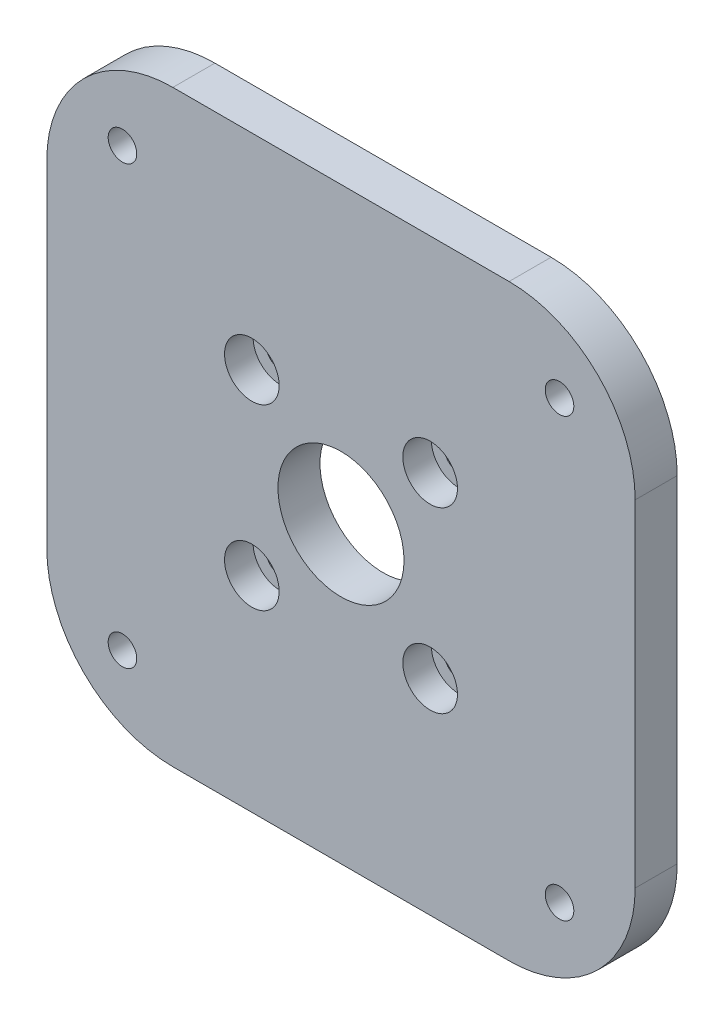
ISO-10303-21;
HEADER;
FILE_DESCRIPTION(('STEP AP214'),'2;1');
FILE_NAME('part.step','',(''),(''),'','','');
FILE_SCHEMA(('AUTOMOTIVE_DESIGN { 1 0 10303 214 1 1 1 1 }'));
ENDSEC;
DATA;
#1=APPLICATION_CONTEXT('core data for automotive mechanical design processes');
#2=APPLICATION_PROTOCOL_DEFINITION('international standard','automotive_design',2000,#1);
#3=PRODUCT_CONTEXT('',#1,'mechanical');
#4=PRODUCT('Part','Part','',(#3));
#5=PRODUCT_RELATED_PRODUCT_CATEGORY('part','',(#4));
#6=PRODUCT_DEFINITION_FORMATION('','',#4);
#7=PRODUCT_DEFINITION_CONTEXT('part definition',#1,'design');
#8=PRODUCT_DEFINITION('design','',#6,#7);
#9=PRODUCT_DEFINITION_SHAPE('','',#8);
#10=(LENGTH_UNIT() NAMED_UNIT(*) SI_UNIT(.MILLI.,.METRE.));
#11=(NAMED_UNIT(*) PLANE_ANGLE_UNIT() SI_UNIT($,.RADIAN.));
#12=(NAMED_UNIT(*) SI_UNIT($,.STERADIAN.) SOLID_ANGLE_UNIT());
#13=UNCERTAINTY_MEASURE_WITH_UNIT(LENGTH_MEASURE(1.E-05),#10,'distance_accuracy_value','');
#14=(GEOMETRIC_REPRESENTATION_CONTEXT(3) GLOBAL_UNCERTAINTY_ASSIGNED_CONTEXT((#13)) GLOBAL_UNIT_ASSIGNED_CONTEXT((#10,
#11,#12)) REPRESENTATION_CONTEXT('',''));
#15=CARTESIAN_POINT('',(0.,0.,0.));
#16=DIRECTION('',(0.,0.,1.));
#17=DIRECTION('',(1.,0.,0.));
#18=AXIS2_PLACEMENT_3D('',#15,#16,#17);
#19=CARTESIAN_POINT('',(35.,35.,5.));
#20=DIRECTION('',(-1.,0.,0.));
#21=DIRECTION('',(0.,0.,1.));
#22=AXIS2_PLACEMENT_3D('',#19,#20,#21);
#23=PLANE('',#22);
#24=DIRECTION('',(0.,1.,0.));
#25=VECTOR('',#24,1.);
#26=CARTESIAN_POINT('',(35.,35.,0.));
#27=LINE('',#26,#25);
#28=CARTESIAN_POINT('',(35.,-20.,0.));
#29=VERTEX_POINT('',#28);
#30=CARTESIAN_POINT('',(35.,20.,0.));
#31=VERTEX_POINT('',#30);
#32=EDGE_CURVE('E186',#29,#31,#27,.T.);
#33=ORIENTED_EDGE('',*,*,#32,.T.);
#34=DIRECTION('',(0.,0.,-1.));
#35=VECTOR('',#34,1.);
#36=CARTESIAN_POINT('',(35.,20.,5.));
#37=LINE('',#36,#35);
#38=CARTESIAN_POINT('',(35.,20.,5.));
#39=VERTEX_POINT('',#38);
#40=EDGE_CURVE('E11',#31,#39,#37,.F.);
#41=ORIENTED_EDGE('',*,*,#40,.T.);
#42=DIRECTION('',(0.,1.,0.));
#43=VECTOR('',#42,1.);
#44=CARTESIAN_POINT('',(35.,35.,5.));
#45=LINE('',#44,#43);
#46=CARTESIAN_POINT('',(35.,-20.,5.));
#47=VERTEX_POINT('',#46);
#48=EDGE_CURVE('E139',#47,#39,#45,.T.);
#49=ORIENTED_EDGE('',*,*,#48,.F.);
#50=DIRECTION('',(0.,0.,-1.));
#51=VECTOR('',#50,1.);
#52=CARTESIAN_POINT('',(35.,-20.,5.));
#53=LINE('',#52,#51);
#54=EDGE_CURVE('E52',#47,#29,#53,.T.);
#55=ORIENTED_EDGE('',*,*,#54,.T.);
#56=EDGE_LOOP('',(#33,#41,#49,#55));
#57=FACE_BOUND('',#56,.T.);
#58=ADVANCED_FACE('F43',(#57),#23,.F.);
#59=CARTESIAN_POINT('',(-35.,35.,5.));
#60=DIRECTION('',(0.,-1.,0.));
#61=DIRECTION('',(0.,0.,-1.));
#62=AXIS2_PLACEMENT_3D('',#59,#60,#61);
#63=PLANE('',#62);
#64=DIRECTION('',(-1.,0.,0.));
#65=VECTOR('',#64,1.);
#66=CARTESIAN_POINT('',(-35.,35.,0.));
#67=LINE('',#66,#65);
#68=CARTESIAN_POINT('',(20.,35.,0.));
#69=VERTEX_POINT('',#68);
#70=CARTESIAN_POINT('',(-20.,35.,0.));
#71=VERTEX_POINT('',#70);
#72=EDGE_CURVE('E146',#69,#71,#67,.T.);
#73=ORIENTED_EDGE('',*,*,#72,.T.);
#74=DIRECTION('',(0.,0.,-1.));
#75=VECTOR('',#74,1.);
#76=CARTESIAN_POINT('',(-20.,35.,5.));
#77=LINE('',#76,#75);
#78=CARTESIAN_POINT('',(-20.,35.,5.));
#79=VERTEX_POINT('',#78);
#80=EDGE_CURVE('E59',#71,#79,#77,.F.);
#81=ORIENTED_EDGE('',*,*,#80,.T.);
#82=DIRECTION('',(-1.,0.,0.));
#83=VECTOR('',#82,1.);
#84=CARTESIAN_POINT('',(-35.,35.,5.));
#85=LINE('',#84,#83);
#86=CARTESIAN_POINT('',(20.,35.,5.));
#87=VERTEX_POINT('',#86);
#88=EDGE_CURVE('E144',#87,#79,#85,.T.);
#89=ORIENTED_EDGE('',*,*,#88,.F.);
#90=DIRECTION('',(0.,0.,-1.));
#91=VECTOR('',#90,1.);
#92=CARTESIAN_POINT('',(20.,35.,5.));
#93=LINE('',#92,#91);
#94=EDGE_CURVE('E175',#87,#69,#93,.T.);
#95=ORIENTED_EDGE('',*,*,#94,.T.);
#96=EDGE_LOOP('',(#73,#81,#89,#95));
#97=FACE_BOUND('',#96,.T.);
#98=ADVANCED_FACE('F336',(#97),#63,.F.);
#99=CARTESIAN_POINT('',(-35.,35.,5.));
#100=DIRECTION('',(1.,0.,0.));
#101=DIRECTION('',(0.,0.,-1.));
#102=AXIS2_PLACEMENT_3D('',#99,#100,#101);
#103=PLANE('',#102);
#104=DIRECTION('',(0.,-1.,0.));
#105=VECTOR('',#104,1.);
#106=CARTESIAN_POINT('',(-35.,35.,0.));
#107=LINE('',#106,#105);
#108=CARTESIAN_POINT('',(-35.,20.,0.));
#109=VERTEX_POINT('',#108);
#110=CARTESIAN_POINT('',(-35.,-20.,0.));
#111=VERTEX_POINT('',#110);
#112=EDGE_CURVE('E140',#109,#111,#107,.T.);
#113=ORIENTED_EDGE('',*,*,#112,.T.);
#114=DIRECTION('',(0.,0.,-1.));
#115=VECTOR('',#114,1.);
#116=CARTESIAN_POINT('',(-35.,-20.,5.));
#117=LINE('',#116,#115);
#118=CARTESIAN_POINT('',(-35.,-20.,5.));
#119=VERTEX_POINT('',#118);
#120=EDGE_CURVE('E115',#111,#119,#117,.F.);
#121=ORIENTED_EDGE('',*,*,#120,.T.);
#122=DIRECTION('',(0.,-1.,0.));
#123=VECTOR('',#122,1.);
#124=CARTESIAN_POINT('',(-35.,35.,5.));
#125=LINE('',#124,#123);
#126=CARTESIAN_POINT('',(-35.,20.,5.));
#127=VERTEX_POINT('',#126);
#128=EDGE_CURVE('E202',#127,#119,#125,.T.);
#129=ORIENTED_EDGE('',*,*,#128,.F.);
#130=DIRECTION('',(0.,0.,-1.));
#131=VECTOR('',#130,1.);
#132=CARTESIAN_POINT('',(-35.,20.,5.));
#133=LINE('',#132,#131);
#134=EDGE_CURVE('E121',#127,#109,#133,.T.);
#135=ORIENTED_EDGE('',*,*,#134,.T.);
#136=EDGE_LOOP('',(#113,#121,#129,#135));
#137=FACE_BOUND('',#136,.T.);
#138=ADVANCED_FACE('F333',(#137),#103,.F.);
#139=CARTESIAN_POINT('',(-35.,-35.,5.));
#140=DIRECTION('',(0.,1.,0.));
#141=DIRECTION('',(0.,0.,1.));
#142=AXIS2_PLACEMENT_3D('',#139,#140,#141);
#143=PLANE('',#142);
#144=DIRECTION('',(1.,0.,0.));
#145=VECTOR('',#144,1.);
#146=CARTESIAN_POINT('',(-35.,-35.,5.));
#147=LINE('',#146,#145);
#148=CARTESIAN_POINT('',(-20.,-35.,5.));
#149=VERTEX_POINT('',#148);
#150=CARTESIAN_POINT('',(20.,-35.,5.));
#151=VERTEX_POINT('',#150);
#152=EDGE_CURVE('E131',#149,#151,#147,.T.);
#153=ORIENTED_EDGE('',*,*,#152,.F.);
#154=DIRECTION('',(0.,0.,-1.));
#155=VECTOR('',#154,1.);
#156=CARTESIAN_POINT('',(-20.,-35.,5.));
#157=LINE('',#156,#155);
#158=CARTESIAN_POINT('',(-20.,-35.,0.));
#159=VERTEX_POINT('',#158);
#160=EDGE_CURVE('E114',#149,#159,#157,.T.);
#161=ORIENTED_EDGE('',*,*,#160,.T.);
#162=DIRECTION('',(1.,0.,0.));
#163=VECTOR('',#162,1.);
#164=CARTESIAN_POINT('',(-35.,-35.,0.));
#165=LINE('',#164,#163);
#166=CARTESIAN_POINT('',(20.,-35.,0.));
#167=VERTEX_POINT('',#166);
#168=EDGE_CURVE('E128',#159,#167,#165,.T.);
#169=ORIENTED_EDGE('',*,*,#168,.T.);
#170=DIRECTION('',(0.,0.,-1.));
#171=VECTOR('',#170,1.);
#172=CARTESIAN_POINT('',(20.,-35.,5.));
#173=LINE('',#172,#171);
#174=EDGE_CURVE('E134',#167,#151,#173,.F.);
#175=ORIENTED_EDGE('',*,*,#174,.T.);
#176=EDGE_LOOP('',(#153,#161,#169,#175));
#177=FACE_BOUND('',#176,.T.);
#178=ADVANCED_FACE('F127',(#177),#143,.F.);
#179=CARTESIAN_POINT('',(0.,0.,5.));
#180=DIRECTION('',(0.,0.,1.));
#181=DIRECTION('',(1.,0.,0.));
#182=AXIS2_PLACEMENT_3D('',#179,#180,#181);
#183=PLANE('',#182);
#184=CARTESIAN_POINT('',(26.0000000000001,26.,5.));
#185=DIRECTION('',(0.,0.,1.));
#186=DIRECTION('',(1.,0.,0.));
#187=AXIS2_PLACEMENT_3D('',#184,#185,#186);
#188=CIRCLE('',#187,1.7);
#189=CARTESIAN_POINT('',(27.7000000000001,26.,5.));
#190=VERTEX_POINT('',#189);
#191=EDGE_CURVE('E303',#190,#190,#188,.T.);
#192=ORIENTED_EDGE('',*,*,#191,.F.);
#193=EDGE_LOOP('',(#192));
#194=FACE_BOUND('',#193,.T.);
#195=CARTESIAN_POINT('',(-26.,26.,5.));
#196=DIRECTION('',(0.,0.,1.));
#197=DIRECTION('',(1.,0.,0.));
#198=AXIS2_PLACEMENT_3D('',#195,#196,#197);
#199=CIRCLE('',#198,1.7);
#200=CARTESIAN_POINT('',(-24.3,26.,5.));
#201=VERTEX_POINT('',#200);
#202=EDGE_CURVE('E295',#201,#201,#199,.T.);
#203=ORIENTED_EDGE('',*,*,#202,.F.);
#204=EDGE_LOOP('',(#203));
#205=FACE_BOUND('',#204,.T.);
#206=CARTESIAN_POINT('',(-26.,-26.,5.));
#207=DIRECTION('',(0.,0.,1.));
#208=DIRECTION('',(1.,0.,0.));
#209=AXIS2_PLACEMENT_3D('',#206,#207,#208);
#210=CIRCLE('',#209,1.7);
#211=CARTESIAN_POINT('',(-24.3,-26.,5.));
#212=VERTEX_POINT('',#211);
#213=EDGE_CURVE('E287',#212,#212,#210,.T.);
#214=ORIENTED_EDGE('',*,*,#213,.F.);
#215=EDGE_LOOP('',(#214));
#216=FACE_BOUND('',#215,.T.);
#217=CARTESIAN_POINT('',(26.,-26.0000000000001,5.));
#218=DIRECTION('',(0.,0.,1.));
#219=DIRECTION('',(1.,0.,0.));
#220=AXIS2_PLACEMENT_3D('',#217,#218,#219);
#221=CIRCLE('',#220,1.7);
#222=CARTESIAN_POINT('',(27.7,-26.0000000000001,5.));
#223=VERTEX_POINT('',#222);
#224=EDGE_CURVE('E279',#223,#223,#221,.T.);
#225=ORIENTED_EDGE('',*,*,#224,.F.);
#226=EDGE_LOOP('',(#225));
#227=FACE_BOUND('',#226,.T.);
#228=CARTESIAN_POINT('',(0.,0.,5.));
#229=DIRECTION('',(0.,0.,1.));
#230=DIRECTION('',(1.,0.,0.));
#231=AXIS2_PLACEMENT_3D('',#228,#229,#230);
#232=CIRCLE('',#231,7.5);
#233=CARTESIAN_POINT('',(7.5,0.,5.));
#234=VERTEX_POINT('',#233);
#235=EDGE_CURVE('E268',#234,#234,#232,.T.);
#236=ORIENTED_EDGE('',*,*,#235,.F.);
#237=EDGE_LOOP('',(#236));
#238=FACE_BOUND('',#237,.T.);
#239=CARTESIAN_POINT('',(-10.6066017177982,-10.6066017177982,5.));
#240=DIRECTION('',(0.,0.,1.));
#241=DIRECTION('',(1.,0.,0.));
#242=AXIS2_PLACEMENT_3D('',#239,#240,#241);
#243=CIRCLE('',#242,3.25);
#244=CARTESIAN_POINT('',(-7.35660171779822,-10.6066017177982,5.));
#245=VERTEX_POINT('',#244);
#246=EDGE_CURVE('E263',#245,#245,#243,.T.);
#247=ORIENTED_EDGE('',*,*,#246,.F.);
#248=EDGE_LOOP('',(#247));
#249=FACE_BOUND('',#248,.T.);
#250=CARTESIAN_POINT('',(-10.6066017177982,10.6066017177982,5.));
#251=DIRECTION('',(0.,0.,1.));
#252=DIRECTION('',(1.,0.,0.));
#253=AXIS2_PLACEMENT_3D('',#250,#251,#252);
#254=CIRCLE('',#253,3.25);
#255=CARTESIAN_POINT('',(-7.35660171779822,10.6066017177982,5.));
#256=VERTEX_POINT('',#255);
#257=EDGE_CURVE('E247',#256,#256,#254,.T.);
#258=ORIENTED_EDGE('',*,*,#257,.F.);
#259=EDGE_LOOP('',(#258));
#260=FACE_BOUND('',#259,.T.);
#261=CARTESIAN_POINT('',(10.6066017177982,10.6066017177982,5.));
#262=DIRECTION('',(0.,0.,1.));
#263=DIRECTION('',(1.,0.,0.));
#264=AXIS2_PLACEMENT_3D('',#261,#262,#263);
#265=CIRCLE('',#264,3.25);
#266=CARTESIAN_POINT('',(13.8566017177982,10.6066017177982,5.));
#267=VERTEX_POINT('',#266);
#268=EDGE_CURVE('E231',#267,#267,#265,.T.);
#269=ORIENTED_EDGE('',*,*,#268,.F.);
#270=EDGE_LOOP('',(#269));
#271=FACE_BOUND('',#270,.T.);
#272=CARTESIAN_POINT('',(10.6066017177982,-10.6066017177982,5.));
#273=DIRECTION('',(0.,0.,1.));
#274=DIRECTION('',(1.,0.,0.));
#275=AXIS2_PLACEMENT_3D('',#272,#273,#274);
#276=CIRCLE('',#275,3.25);
#277=CARTESIAN_POINT('',(13.8566017177982,-10.6066017177982,5.));
#278=VERTEX_POINT('',#277);
#279=EDGE_CURVE('E215',#278,#278,#276,.T.);
#280=ORIENTED_EDGE('',*,*,#279,.F.);
#281=EDGE_LOOP('',(#280));
#282=FACE_BOUND('',#281,.T.);
#283=ORIENTED_EDGE('',*,*,#128,.T.);
#284=CARTESIAN_POINT('',(-20.,-20.,5.));
#285=DIRECTION('',(0.,0.,1.));
#286=DIRECTION('',(1.,0.,0.));
#287=AXIS2_PLACEMENT_3D('',#284,#285,#286);
#288=CIRCLE('',#287,15.);
#289=EDGE_CURVE('E172',#119,#149,#288,.T.);
#290=ORIENTED_EDGE('',*,*,#289,.T.);
#291=ORIENTED_EDGE('',*,*,#152,.T.);
#292=CARTESIAN_POINT('',(20.,-20.,5.));
#293=DIRECTION('',(0.,0.,1.));
#294=DIRECTION('',(1.,0.,0.));
#295=AXIS2_PLACEMENT_3D('',#292,#293,#294);
#296=CIRCLE('',#295,15.);
#297=EDGE_CURVE('E164',#151,#47,#296,.T.);
#298=ORIENTED_EDGE('',*,*,#297,.T.);
#299=ORIENTED_EDGE('',*,*,#48,.T.);
#300=CARTESIAN_POINT('',(20.,20.,5.));
#301=DIRECTION('',(0.,0.,1.));
#302=DIRECTION('',(1.,0.,0.));
#303=AXIS2_PLACEMENT_3D('',#300,#301,#302);
#304=CIRCLE('',#303,15.);
#305=EDGE_CURVE('E66',#39,#87,#304,.T.);
#306=ORIENTED_EDGE('',*,*,#305,.T.);
#307=ORIENTED_EDGE('',*,*,#88,.T.);
#308=CARTESIAN_POINT('',(-20.,20.,5.));
#309=DIRECTION('',(0.,0.,1.));
#310=DIRECTION('',(1.,0.,0.));
#311=AXIS2_PLACEMENT_3D('',#308,#309,#310);
#312=CIRCLE('',#311,15.);
#313=EDGE_CURVE('E169',#79,#127,#312,.T.);
#314=ORIENTED_EDGE('',*,*,#313,.T.);
#315=EDGE_LOOP('',(#283,#290,#291,#298,#299,#306,#307,#314));
#316=FACE_BOUND('',#315,.T.);
#317=ADVANCED_FACE('F310',(#194,#205,#216,#227,#238,#249,#260,#271,#282,#316),#183,.T.);
#318=CARTESIAN_POINT('',(0.,0.,0.));
#319=DIRECTION('',(0.,0.,1.));
#320=DIRECTION('',(1.,0.,0.));
#321=AXIS2_PLACEMENT_3D('',#318,#319,#320);
#322=PLANE('',#321);
#323=CARTESIAN_POINT('',(26.0000000000001,26.,0.));
#324=DIRECTION('',(0.,0.,1.));
#325=DIRECTION('',(1.,0.,0.));
#326=AXIS2_PLACEMENT_3D('',#323,#324,#325);
#327=CIRCLE('',#326,1.7);
#328=CARTESIAN_POINT('',(27.7000000000001,26.,0.));
#329=VERTEX_POINT('',#328);
#330=EDGE_CURVE('E299',#329,#329,#327,.T.);
#331=ORIENTED_EDGE('',*,*,#330,.T.);
#332=EDGE_LOOP('',(#331));
#333=FACE_BOUND('',#332,.T.);
#334=CARTESIAN_POINT('',(-26.,26.,0.));
#335=DIRECTION('',(0.,0.,1.));
#336=DIRECTION('',(1.,0.,0.));
#337=AXIS2_PLACEMENT_3D('',#334,#335,#336);
#338=CIRCLE('',#337,1.7);
#339=CARTESIAN_POINT('',(-24.3,26.,0.));
#340=VERTEX_POINT('',#339);
#341=EDGE_CURVE('E291',#340,#340,#338,.T.);
#342=ORIENTED_EDGE('',*,*,#341,.T.);
#343=EDGE_LOOP('',(#342));
#344=FACE_BOUND('',#343,.T.);
#345=CARTESIAN_POINT('',(-26.,-26.,0.));
#346=DIRECTION('',(0.,0.,1.));
#347=DIRECTION('',(1.,0.,0.));
#348=AXIS2_PLACEMENT_3D('',#345,#346,#347);
#349=CIRCLE('',#348,1.7);
#350=CARTESIAN_POINT('',(-24.3,-26.,0.));
#351=VERTEX_POINT('',#350);
#352=EDGE_CURVE('E283',#351,#351,#349,.T.);
#353=ORIENTED_EDGE('',*,*,#352,.T.);
#354=EDGE_LOOP('',(#353));
#355=FACE_BOUND('',#354,.T.);
#356=CARTESIAN_POINT('',(26.,-26.0000000000001,0.));
#357=DIRECTION('',(0.,0.,1.));
#358=DIRECTION('',(1.,0.,0.));
#359=AXIS2_PLACEMENT_3D('',#356,#357,#358);
#360=CIRCLE('',#359,1.7);
#361=CARTESIAN_POINT('',(27.7,-26.0000000000001,0.));
#362=VERTEX_POINT('',#361);
#363=EDGE_CURVE('E272',#362,#362,#360,.T.);
#364=ORIENTED_EDGE('',*,*,#363,.T.);
#365=EDGE_LOOP('',(#364));
#366=FACE_BOUND('',#365,.T.);
#367=CARTESIAN_POINT('',(0.,0.,0.));
#368=DIRECTION('',(0.,0.,1.));
#369=DIRECTION('',(1.,0.,0.));
#370=AXIS2_PLACEMENT_3D('',#367,#368,#369);
#371=CIRCLE('',#370,7.5);
#372=CARTESIAN_POINT('',(7.5,0.,0.));
#373=VERTEX_POINT('',#372);
#374=EDGE_CURVE('E267',#373,#373,#371,.T.);
#375=ORIENTED_EDGE('',*,*,#374,.T.);
#376=EDGE_LOOP('',(#375));
#377=FACE_BOUND('',#376,.T.);
#378=CARTESIAN_POINT('',(-10.6066017177982,-10.6066017177982,0.));
#379=DIRECTION('',(0.,0.,1.));
#380=DIRECTION('',(1.,0.,0.));
#381=AXIS2_PLACEMENT_3D('',#378,#379,#380);
#382=CIRCLE('',#381,1.7);
#383=CARTESIAN_POINT('',(-8.90660171779822,-10.6066017177982,0.));
#384=VERTEX_POINT('',#383);
#385=EDGE_CURVE('E251',#384,#384,#382,.T.);
#386=ORIENTED_EDGE('',*,*,#385,.T.);
#387=EDGE_LOOP('',(#386));
#388=FACE_BOUND('',#387,.T.);
#389=CARTESIAN_POINT('',(-10.6066017177982,10.6066017177982,0.));
#390=DIRECTION('',(0.,0.,1.));
#391=DIRECTION('',(1.,0.,0.));
#392=AXIS2_PLACEMENT_3D('',#389,#390,#391);
#393=CIRCLE('',#392,1.7);
#394=CARTESIAN_POINT('',(-8.90660171779822,10.6066017177982,0.));
#395=VERTEX_POINT('',#394);
#396=EDGE_CURVE('E235',#395,#395,#393,.T.);
#397=ORIENTED_EDGE('',*,*,#396,.T.);
#398=EDGE_LOOP('',(#397));
#399=FACE_BOUND('',#398,.T.);
#400=CARTESIAN_POINT('',(10.6066017177982,10.6066017177982,0.));
#401=DIRECTION('',(0.,0.,1.));
#402=DIRECTION('',(1.,0.,0.));
#403=AXIS2_PLACEMENT_3D('',#400,#401,#402);
#404=CIRCLE('',#403,1.7);
#405=CARTESIAN_POINT('',(12.3066017177982,10.6066017177982,0.));
#406=VERTEX_POINT('',#405);
#407=EDGE_CURVE('E219',#406,#406,#404,.T.);
#408=ORIENTED_EDGE('',*,*,#407,.T.);
#409=EDGE_LOOP('',(#408));
#410=FACE_BOUND('',#409,.T.);
#411=CARTESIAN_POINT('',(10.6066017177982,-10.6066017177982,0.));
#412=DIRECTION('',(0.,0.,1.));
#413=DIRECTION('',(1.,0.,0.));
#414=AXIS2_PLACEMENT_3D('',#411,#412,#413);
#415=CIRCLE('',#414,1.7);
#416=CARTESIAN_POINT('',(12.3066017177982,-10.6066017177982,0.));
#417=VERTEX_POINT('',#416);
#418=EDGE_CURVE('E192',#417,#417,#415,.T.);
#419=ORIENTED_EDGE('',*,*,#418,.T.);
#420=EDGE_LOOP('',(#419));
#421=FACE_BOUND('',#420,.T.);
#422=ORIENTED_EDGE('',*,*,#168,.F.);
#423=CARTESIAN_POINT('',(-20.,-20.,0.));
#424=DIRECTION('',(0.,0.,1.));
#425=DIRECTION('',(1.,0.,0.));
#426=AXIS2_PLACEMENT_3D('',#423,#424,#425);
#427=CIRCLE('',#426,15.);
#428=EDGE_CURVE('E110',#159,#111,#427,.F.);
#429=ORIENTED_EDGE('',*,*,#428,.T.);
#430=ORIENTED_EDGE('',*,*,#112,.F.);
#431=CARTESIAN_POINT('',(-20.,20.,0.));
#432=DIRECTION('',(0.,0.,1.));
#433=DIRECTION('',(1.,0.,0.));
#434=AXIS2_PLACEMENT_3D('',#431,#432,#433);
#435=CIRCLE('',#434,15.);
#436=EDGE_CURVE('E122',#109,#71,#435,.F.);
#437=ORIENTED_EDGE('',*,*,#436,.T.);
#438=ORIENTED_EDGE('',*,*,#72,.F.);
#439=CARTESIAN_POINT('',(20.,20.,0.));
#440=DIRECTION('',(0.,0.,1.));
#441=DIRECTION('',(1.,0.,0.));
#442=AXIS2_PLACEMENT_3D('',#439,#440,#441);
#443=CIRCLE('',#442,15.);
#444=EDGE_CURVE('E154',#69,#31,#443,.F.);
#445=ORIENTED_EDGE('',*,*,#444,.T.);
#446=ORIENTED_EDGE('',*,*,#32,.F.);
#447=CARTESIAN_POINT('',(20.,-20.,0.));
#448=DIRECTION('',(0.,0.,1.));
#449=DIRECTION('',(1.,0.,0.));
#450=AXIS2_PLACEMENT_3D('',#447,#448,#449);
#451=CIRCLE('',#450,15.);
#452=EDGE_CURVE('E133',#29,#167,#451,.F.);
#453=ORIENTED_EDGE('',*,*,#452,.T.);
#454=EDGE_LOOP('',(#422,#429,#430,#437,#438,#445,#446,#453));
#455=FACE_BOUND('',#454,.T.);
#456=ADVANCED_FACE('F136',(#333,#344,#355,#366,#377,#388,#399,#410,#421,#455),#322,.F.);
#457=CARTESIAN_POINT('',(-20.,-20.,5.));
#458=DIRECTION('',(0.,0.,-1.));
#459=DIRECTION('',(-1.,0.,0.));
#460=AXIS2_PLACEMENT_3D('',#457,#458,#459);
#461=CYLINDRICAL_SURFACE('',#460,15.);
#462=ORIENTED_EDGE('',*,*,#289,.F.);
#463=ORIENTED_EDGE('',*,*,#120,.F.);
#464=ORIENTED_EDGE('',*,*,#428,.F.);
#465=ORIENTED_EDGE('',*,*,#160,.F.);
#466=EDGE_LOOP('',(#462,#463,#464,#465));
#467=FACE_BOUND('',#466,.T.);
#468=ADVANCED_FACE('F113',(#467),#461,.T.);
#469=CARTESIAN_POINT('',(-20.,20.,5.));
#470=DIRECTION('',(0.,0.,-1.));
#471=DIRECTION('',(-1.,0.,0.));
#472=AXIS2_PLACEMENT_3D('',#469,#470,#471);
#473=CYLINDRICAL_SURFACE('',#472,15.);
#474=ORIENTED_EDGE('',*,*,#313,.F.);
#475=ORIENTED_EDGE('',*,*,#80,.F.);
#476=ORIENTED_EDGE('',*,*,#436,.F.);
#477=ORIENTED_EDGE('',*,*,#134,.F.);
#478=EDGE_LOOP('',(#474,#475,#476,#477));
#479=FACE_BOUND('',#478,.T.);
#480=ADVANCED_FACE('F335',(#479),#473,.T.);
#481=CARTESIAN_POINT('',(20.,20.,5.));
#482=DIRECTION('',(0.,0.,-1.));
#483=DIRECTION('',(-1.,0.,0.));
#484=AXIS2_PLACEMENT_3D('',#481,#482,#483);
#485=CYLINDRICAL_SURFACE('',#484,15.);
#486=ORIENTED_EDGE('',*,*,#305,.F.);
#487=ORIENTED_EDGE('',*,*,#40,.F.);
#488=ORIENTED_EDGE('',*,*,#444,.F.);
#489=ORIENTED_EDGE('',*,*,#94,.F.);
#490=EDGE_LOOP('',(#486,#487,#488,#489));
#491=FACE_BOUND('',#490,.T.);
#492=ADVANCED_FACE('F339',(#491),#485,.T.);
#493=CARTESIAN_POINT('',(20.,-20.,5.));
#494=DIRECTION('',(0.,0.,-1.));
#495=DIRECTION('',(-1.,0.,0.));
#496=AXIS2_PLACEMENT_3D('',#493,#494,#495);
#497=CYLINDRICAL_SURFACE('',#496,15.);
#498=ORIENTED_EDGE('',*,*,#297,.F.);
#499=ORIENTED_EDGE('',*,*,#174,.F.);
#500=ORIENTED_EDGE('',*,*,#452,.F.);
#501=ORIENTED_EDGE('',*,*,#54,.F.);
#502=EDGE_LOOP('',(#498,#499,#500,#501));
#503=FACE_BOUND('',#502,.T.);
#504=ADVANCED_FACE('F45',(#503),#497,.T.);
#505=CARTESIAN_POINT('',(10.6066017177982,-10.6066017177982,5.));
#506=DIRECTION('',(0.,0.,1.));
#507=DIRECTION('',(1.,0.,0.));
#508=AXIS2_PLACEMENT_3D('',#505,#506,#507);
#509=CYLINDRICAL_SURFACE('',#508,1.7);
#510=ORIENTED_EDGE('',*,*,#418,.F.);
#511=EDGE_LOOP('',(#510));
#512=FACE_BOUND('',#511,.T.);
#513=CARTESIAN_POINT('',(10.6066017177982,-10.6066017177982,1.6));
#514=DIRECTION('',(0.,0.,1.));
#515=DIRECTION('',(1.,0.,0.));
#516=AXIS2_PLACEMENT_3D('',#513,#514,#515);
#517=CIRCLE('',#516,1.7);
#518=CARTESIAN_POINT('',(12.3066017177982,-10.6066017177982,1.6));
#519=VERTEX_POINT('',#518);
#520=EDGE_CURVE('E197',#519,#519,#517,.T.);
#521=ORIENTED_EDGE('',*,*,#520,.T.);
#522=EDGE_LOOP('',(#521));
#523=FACE_BOUND('',#522,.T.);
#524=ADVANCED_FACE('F341',(#512,#523),#509,.F.);
#525=CARTESIAN_POINT('',(12.3066017177982,-10.6066017177982,1.6));
#526=DIRECTION('',(0.,0.,-1.));
#527=DIRECTION('',(-1.,0.,0.));
#528=AXIS2_PLACEMENT_3D('',#525,#526,#527);
#529=PLANE('',#528);
#530=ORIENTED_EDGE('',*,*,#520,.F.);
#531=EDGE_LOOP('',(#530));
#532=FACE_BOUND('',#531,.T.);
#533=CARTESIAN_POINT('',(10.6066017177982,-10.6066017177982,1.6));
#534=DIRECTION('',(0.,0.,1.));
#535=DIRECTION('',(1.,0.,0.));
#536=AXIS2_PLACEMENT_3D('',#533,#534,#535);
#537=CIRCLE('',#536,3.25);
#538=CARTESIAN_POINT('',(13.8566017177982,-10.6066017177982,1.6));
#539=VERTEX_POINT('',#538);
#540=EDGE_CURVE('E211',#539,#539,#537,.T.);
#541=ORIENTED_EDGE('',*,*,#540,.T.);
#542=EDGE_LOOP('',(#541));
#543=FACE_BOUND('',#542,.T.);
#544=ADVANCED_FACE('F346',(#532,#543),#529,.F.);
#545=CARTESIAN_POINT('',(10.6066017177982,-10.6066017177982,5.));
#546=DIRECTION('',(0.,0.,1.));
#547=DIRECTION('',(1.,0.,0.));
#548=AXIS2_PLACEMENT_3D('',#545,#546,#547);
#549=CYLINDRICAL_SURFACE('',#548,3.25);
#550=ORIENTED_EDGE('',*,*,#540,.F.);
#551=EDGE_LOOP('',(#550));
#552=FACE_BOUND('',#551,.T.);
#553=ORIENTED_EDGE('',*,*,#279,.T.);
#554=EDGE_LOOP('',(#553));
#555=FACE_BOUND('',#554,.T.);
#556=ADVANCED_FACE('F382',(#552,#555),#549,.F.);
#557=CARTESIAN_POINT('',(10.6066017177982,10.6066017177982,5.));
#558=DIRECTION('',(0.,0.,1.));
#559=DIRECTION('',(1.,0.,0.));
#560=AXIS2_PLACEMENT_3D('',#557,#558,#559);
#561=CYLINDRICAL_SURFACE('',#560,1.7);
#562=ORIENTED_EDGE('',*,*,#407,.F.);
#563=EDGE_LOOP('',(#562));
#564=FACE_BOUND('',#563,.T.);
#565=CARTESIAN_POINT('',(10.6066017177982,10.6066017177982,1.6));
#566=DIRECTION('',(0.,0.,1.));
#567=DIRECTION('',(1.,0.,0.));
#568=AXIS2_PLACEMENT_3D('',#565,#566,#567);
#569=CIRCLE('',#568,1.7);
#570=CARTESIAN_POINT('',(12.3066017177982,10.6066017177982,1.6));
#571=VERTEX_POINT('',#570);
#572=EDGE_CURVE('E223',#571,#571,#569,.T.);
#573=ORIENTED_EDGE('',*,*,#572,.T.);
#574=EDGE_LOOP('',(#573));
#575=FACE_BOUND('',#574,.T.);
#576=ADVANCED_FACE('F390',(#564,#575),#561,.F.);
#577=CARTESIAN_POINT('',(12.3066017177982,10.6066017177982,1.6));
#578=DIRECTION('',(0.,0.,-1.));
#579=DIRECTION('',(-1.,0.,0.));
#580=AXIS2_PLACEMENT_3D('',#577,#578,#579);
#581=PLANE('',#580);
#582=ORIENTED_EDGE('',*,*,#572,.F.);
#583=EDGE_LOOP('',(#582));
#584=FACE_BOUND('',#583,.T.);
#585=CARTESIAN_POINT('',(10.6066017177982,10.6066017177982,1.6));
#586=DIRECTION('',(0.,0.,1.));
#587=DIRECTION('',(1.,0.,0.));
#588=AXIS2_PLACEMENT_3D('',#585,#586,#587);
#589=CIRCLE('',#588,3.25);
#590=CARTESIAN_POINT('',(13.8566017177982,10.6066017177982,1.6));
#591=VERTEX_POINT('',#590);
#592=EDGE_CURVE('E227',#591,#591,#589,.T.);
#593=ORIENTED_EDGE('',*,*,#592,.T.);
#594=EDGE_LOOP('',(#593));
#595=FACE_BOUND('',#594,.T.);
#596=ADVANCED_FACE('F398',(#584,#595),#581,.F.);
#597=CARTESIAN_POINT('',(10.6066017177982,10.6066017177982,5.));
#598=DIRECTION('',(0.,0.,1.));
#599=DIRECTION('',(1.,0.,0.));
#600=AXIS2_PLACEMENT_3D('',#597,#598,#599);
#601=CYLINDRICAL_SURFACE('',#600,3.25);
#602=ORIENTED_EDGE('',*,*,#592,.F.);
#603=EDGE_LOOP('',(#602));
#604=FACE_BOUND('',#603,.T.);
#605=ORIENTED_EDGE('',*,*,#268,.T.);
#606=EDGE_LOOP('',(#605));
#607=FACE_BOUND('',#606,.T.);
#608=ADVANCED_FACE('F406',(#604,#607),#601,.F.);
#609=CARTESIAN_POINT('',(-10.6066017177982,10.6066017177982,5.));
#610=DIRECTION('',(0.,0.,1.));
#611=DIRECTION('',(1.,0.,0.));
#612=AXIS2_PLACEMENT_3D('',#609,#610,#611);
#613=CYLINDRICAL_SURFACE('',#612,1.7);
#614=ORIENTED_EDGE('',*,*,#396,.F.);
#615=EDGE_LOOP('',(#614));
#616=FACE_BOUND('',#615,.T.);
#617=CARTESIAN_POINT('',(-10.6066017177982,10.6066017177982,1.6));
#618=DIRECTION('',(0.,0.,1.));
#619=DIRECTION('',(1.,0.,0.));
#620=AXIS2_PLACEMENT_3D('',#617,#618,#619);
#621=CIRCLE('',#620,1.7);
#622=CARTESIAN_POINT('',(-8.90660171779822,10.6066017177982,1.6));
#623=VERTEX_POINT('',#622);
#624=EDGE_CURVE('E239',#623,#623,#621,.T.);
#625=ORIENTED_EDGE('',*,*,#624,.T.);
#626=EDGE_LOOP('',(#625));
#627=FACE_BOUND('',#626,.T.);
#628=ADVANCED_FACE('F414',(#616,#627),#613,.F.);
#629=CARTESIAN_POINT('',(-8.90660171779822,10.6066017177982,1.6));
#630=DIRECTION('',(0.,0.,-1.));
#631=DIRECTION('',(-1.,0.,0.));
#632=AXIS2_PLACEMENT_3D('',#629,#630,#631);
#633=PLANE('',#632);
#634=ORIENTED_EDGE('',*,*,#624,.F.);
#635=EDGE_LOOP('',(#634));
#636=FACE_BOUND('',#635,.T.);
#637=CARTESIAN_POINT('',(-10.6066017177982,10.6066017177982,1.6));
#638=DIRECTION('',(0.,0.,1.));
#639=DIRECTION('',(1.,0.,0.));
#640=AXIS2_PLACEMENT_3D('',#637,#638,#639);
#641=CIRCLE('',#640,3.25);
#642=CARTESIAN_POINT('',(-7.35660171779822,10.6066017177982,1.6));
#643=VERTEX_POINT('',#642);
#644=EDGE_CURVE('E243',#643,#643,#641,.T.);
#645=ORIENTED_EDGE('',*,*,#644,.T.);
#646=EDGE_LOOP('',(#645));
#647=FACE_BOUND('',#646,.T.);
#648=ADVANCED_FACE('F422',(#636,#647),#633,.F.);
#649=CARTESIAN_POINT('',(-10.6066017177982,10.6066017177982,5.));
#650=DIRECTION('',(0.,0.,1.));
#651=DIRECTION('',(1.,0.,0.));
#652=AXIS2_PLACEMENT_3D('',#649,#650,#651);
#653=CYLINDRICAL_SURFACE('',#652,3.25);
#654=ORIENTED_EDGE('',*,*,#644,.F.);
#655=EDGE_LOOP('',(#654));
#656=FACE_BOUND('',#655,.T.);
#657=ORIENTED_EDGE('',*,*,#257,.T.);
#658=EDGE_LOOP('',(#657));
#659=FACE_BOUND('',#658,.T.);
#660=ADVANCED_FACE('F430',(#656,#659),#653,.F.);
#661=CARTESIAN_POINT('',(-10.6066017177982,-10.6066017177982,5.));
#662=DIRECTION('',(0.,0.,1.));
#663=DIRECTION('',(1.,0.,0.));
#664=AXIS2_PLACEMENT_3D('',#661,#662,#663);
#665=CYLINDRICAL_SURFACE('',#664,1.7);
#666=ORIENTED_EDGE('',*,*,#385,.F.);
#667=EDGE_LOOP('',(#666));
#668=FACE_BOUND('',#667,.T.);
#669=CARTESIAN_POINT('',(-10.6066017177982,-10.6066017177982,1.6));
#670=DIRECTION('',(0.,0.,1.));
#671=DIRECTION('',(1.,0.,0.));
#672=AXIS2_PLACEMENT_3D('',#669,#670,#671);
#673=CIRCLE('',#672,1.7);
#674=CARTESIAN_POINT('',(-8.90660171779822,-10.6066017177982,1.6));
#675=VERTEX_POINT('',#674);
#676=EDGE_CURVE('E255',#675,#675,#673,.T.);
#677=ORIENTED_EDGE('',*,*,#676,.T.);
#678=EDGE_LOOP('',(#677));
#679=FACE_BOUND('',#678,.T.);
#680=ADVANCED_FACE('F438',(#668,#679),#665,.F.);
#681=CARTESIAN_POINT('',(-8.90660171779822,-10.6066017177982,1.6));
#682=DIRECTION('',(0.,0.,-1.));
#683=DIRECTION('',(-1.,0.,0.));
#684=AXIS2_PLACEMENT_3D('',#681,#682,#683);
#685=PLANE('',#684);
#686=ORIENTED_EDGE('',*,*,#676,.F.);
#687=EDGE_LOOP('',(#686));
#688=FACE_BOUND('',#687,.T.);
#689=CARTESIAN_POINT('',(-10.6066017177982,-10.6066017177982,1.6));
#690=DIRECTION('',(0.,0.,1.));
#691=DIRECTION('',(1.,0.,0.));
#692=AXIS2_PLACEMENT_3D('',#689,#690,#691);
#693=CIRCLE('',#692,3.25);
#694=CARTESIAN_POINT('',(-7.35660171779822,-10.6066017177982,1.6));
#695=VERTEX_POINT('',#694);
#696=EDGE_CURVE('E259',#695,#695,#693,.T.);
#697=ORIENTED_EDGE('',*,*,#696,.T.);
#698=EDGE_LOOP('',(#697));
#699=FACE_BOUND('',#698,.T.);
#700=ADVANCED_FACE('F446',(#688,#699),#685,.F.);
#701=CARTESIAN_POINT('',(-10.6066017177982,-10.6066017177982,5.));
#702=DIRECTION('',(0.,0.,1.));
#703=DIRECTION('',(1.,0.,0.));
#704=AXIS2_PLACEMENT_3D('',#701,#702,#703);
#705=CYLINDRICAL_SURFACE('',#704,3.25);
#706=ORIENTED_EDGE('',*,*,#696,.F.);
#707=EDGE_LOOP('',(#706));
#708=FACE_BOUND('',#707,.T.);
#709=ORIENTED_EDGE('',*,*,#246,.T.);
#710=EDGE_LOOP('',(#709));
#711=FACE_BOUND('',#710,.T.);
#712=ADVANCED_FACE('F454',(#708,#711),#705,.F.);
#713=CARTESIAN_POINT('',(0.,0.,0.));
#714=DIRECTION('',(0.,0.,1.));
#715=DIRECTION('',(1.,0.,0.));
#716=AXIS2_PLACEMENT_3D('',#713,#714,#715);
#717=CYLINDRICAL_SURFACE('',#716,7.5);
#718=ORIENTED_EDGE('',*,*,#374,.F.);
#719=EDGE_LOOP('',(#718));
#720=FACE_BOUND('',#719,.T.);
#721=ORIENTED_EDGE('',*,*,#235,.T.);
#722=EDGE_LOOP('',(#721));
#723=FACE_BOUND('',#722,.T.);
#724=ADVANCED_FACE('F462',(#720,#723),#717,.F.);
#725=CARTESIAN_POINT('',(26.,-26.0000000000001,5.));
#726=DIRECTION('',(0.,0.,1.));
#727=DIRECTION('',(1.,0.,0.));
#728=AXIS2_PLACEMENT_3D('',#725,#726,#727);
#729=CYLINDRICAL_SURFACE('',#728,1.7);
#730=ORIENTED_EDGE('',*,*,#363,.F.);
#731=EDGE_LOOP('',(#730));
#732=FACE_BOUND('',#731,.T.);
#733=ORIENTED_EDGE('',*,*,#224,.T.);
#734=EDGE_LOOP('',(#733));
#735=FACE_BOUND('',#734,.T.);
#736=ADVANCED_FACE('F470',(#732,#735),#729,.F.);
#737=CARTESIAN_POINT('',(-26.,-26.,5.));
#738=DIRECTION('',(0.,0.,1.));
#739=DIRECTION('',(1.,0.,0.));
#740=AXIS2_PLACEMENT_3D('',#737,#738,#739);
#741=CYLINDRICAL_SURFACE('',#740,1.7);
#742=ORIENTED_EDGE('',*,*,#352,.F.);
#743=EDGE_LOOP('',(#742));
#744=FACE_BOUND('',#743,.T.);
#745=ORIENTED_EDGE('',*,*,#213,.T.);
#746=EDGE_LOOP('',(#745));
#747=FACE_BOUND('',#746,.T.);
#748=ADVANCED_FACE('F478',(#744,#747),#741,.F.);
#749=CARTESIAN_POINT('',(-26.,26.,5.));
#750=DIRECTION('',(0.,0.,1.));
#751=DIRECTION('',(1.,0.,0.));
#752=AXIS2_PLACEMENT_3D('',#749,#750,#751);
#753=CYLINDRICAL_SURFACE('',#752,1.7);
#754=ORIENTED_EDGE('',*,*,#341,.F.);
#755=EDGE_LOOP('',(#754));
#756=FACE_BOUND('',#755,.T.);
#757=ORIENTED_EDGE('',*,*,#202,.T.);
#758=EDGE_LOOP('',(#757));
#759=FACE_BOUND('',#758,.T.);
#760=ADVANCED_FACE('F487',(#756,#759),#753,.F.);
#761=CARTESIAN_POINT('',(26.0000000000001,26.,5.));
#762=DIRECTION('',(0.,0.,1.));
#763=DIRECTION('',(1.,0.,0.));
#764=AXIS2_PLACEMENT_3D('',#761,#762,#763);
#765=CYLINDRICAL_SURFACE('',#764,1.7);
#766=ORIENTED_EDGE('',*,*,#330,.F.);
#767=EDGE_LOOP('',(#766));
#768=FACE_BOUND('',#767,.T.);
#769=ORIENTED_EDGE('',*,*,#191,.T.);
#770=EDGE_LOOP('',(#769));
#771=FACE_BOUND('',#770,.T.);
#772=ADVANCED_FACE('F308',(#768,#771),#765,.F.);
#773=CLOSED_SHELL('',(#58,#98,#138,#178,#317,#456,#468,#480,#492,#504,#524,#544,#556,#576,#596,
#608,#628,#648,#660,#680,#700,#712,#724,#736,#748,#760,#772));
#774=MANIFOLD_SOLID_BREP('B2',#773);
#775=ADVANCED_BREP_SHAPE_REPRESENTATION('',(#18,#774),#14);
#776=SHAPE_DEFINITION_REPRESENTATION(#9,#775);
ENDSEC;
END-ISO-10303-21;
